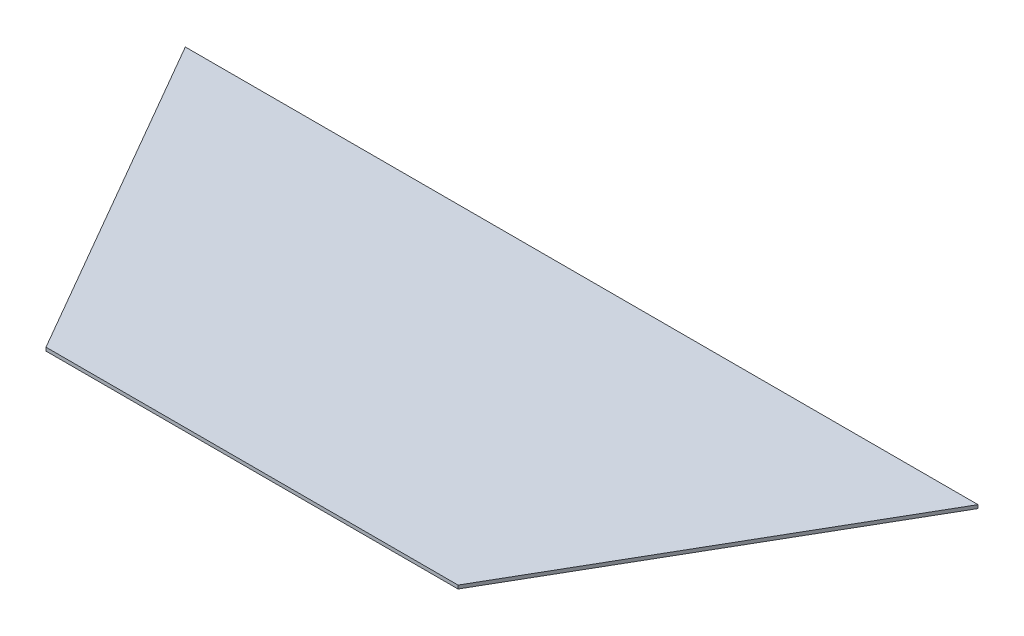
ISO-10303-21;
HEADER;
FILE_DESCRIPTION(('STEP AP214'),'2;1');
FILE_NAME('part.step','',(''),(''),'','','');
FILE_SCHEMA(('AUTOMOTIVE_DESIGN { 1 0 10303 214 1 1 1 1 }'));
ENDSEC;
DATA;
#1=APPLICATION_CONTEXT('core data for automotive mechanical design processes');
#2=APPLICATION_PROTOCOL_DEFINITION('international standard','automotive_design',2000,#1);
#3=PRODUCT_CONTEXT('',#1,'mechanical');
#4=PRODUCT('Part','Part','',(#3));
#5=PRODUCT_RELATED_PRODUCT_CATEGORY('part','',(#4));
#6=PRODUCT_DEFINITION_FORMATION('','',#4);
#7=PRODUCT_DEFINITION_CONTEXT('part definition',#1,'design');
#8=PRODUCT_DEFINITION('design','',#6,#7);
#9=PRODUCT_DEFINITION_SHAPE('','',#8);
#10=(LENGTH_UNIT() NAMED_UNIT(*) SI_UNIT(.MILLI.,.METRE.));
#11=(NAMED_UNIT(*) PLANE_ANGLE_UNIT() SI_UNIT($,.RADIAN.));
#12=(NAMED_UNIT(*) SI_UNIT($,.STERADIAN.) SOLID_ANGLE_UNIT());
#13=UNCERTAINTY_MEASURE_WITH_UNIT(LENGTH_MEASURE(1.E-05),#10,'distance_accuracy_value','');
#14=(GEOMETRIC_REPRESENTATION_CONTEXT(3) GLOBAL_UNCERTAINTY_ASSIGNED_CONTEXT((#13)) GLOBAL_UNIT_ASSIGNED_CONTEXT((#10,
#11,#12)) REPRESENTATION_CONTEXT('',''));
#15=CARTESIAN_POINT('',(0.,0.,0.));
#16=DIRECTION('',(0.,0.,1.));
#17=DIRECTION('',(1.,0.,0.));
#18=AXIS2_PLACEMENT_3D('',#15,#16,#17);
#19=CARTESIAN_POINT('',(0.,6.35,0.));
#20=DIRECTION('',(0.,1.,0.));
#21=DIRECTION('',(0.,0.,1.));
#22=AXIS2_PLACEMENT_3D('',#19,#20,#21);
#23=PLANE('',#22);
#24=DIRECTION('',(0.500000000000017,0.,-0.866025403784429));
#25=VECTOR('',#24,1.);
#26=CARTESIAN_POINT('',(381.,6.35,0.));
#27=LINE('',#26,#25);
#28=CARTESIAN_POINT('',(732.952724097978,6.35,-609.599999999995));
#29=VERTEX_POINT('',#28);
#30=CARTESIAN_POINT('',(381.,6.35,0.));
#31=VERTEX_POINT('',#30);
#32=EDGE_CURVE('E68',#29,#31,#27,.F.);
#33=ORIENTED_EDGE('',*,*,#32,.F.);
#34=DIRECTION('',(1.,0.,0.));
#35=VECTOR('',#34,1.);
#36=CARTESIAN_POINT('',(-1031.57847994737,6.35,-609.6));
#37=LINE('',#36,#35);
#38=CARTESIAN_POINT('',(-732.952724097983,6.35,-609.599999999992));
#39=VERTEX_POINT('',#38);
#40=EDGE_CURVE('E20',#29,#39,#37,.F.);
#41=ORIENTED_EDGE('',*,*,#40,.T.);
#42=DIRECTION('',(0.500000000000017,0.,0.866025403784429));
#43=VECTOR('',#42,1.);
#44=CARTESIAN_POINT('',(-762.,6.35,-659.911357683662));
#45=LINE('',#44,#43);
#46=CARTESIAN_POINT('',(-381.000000000005,6.35,3.20576898360514E-12));
#47=VERTEX_POINT('',#46);
#48=EDGE_CURVE('E58',#47,#39,#45,.F.);
#49=ORIENTED_EDGE('',*,*,#48,.F.);
#50=DIRECTION('',(1.,0.,0.));
#51=VECTOR('',#50,1.);
#52=CARTESIAN_POINT('',(-381.,6.35,0.));
#53=LINE('',#52,#51);
#54=EDGE_CURVE('E53',#31,#47,#53,.F.);
#55=ORIENTED_EDGE('',*,*,#54,.F.);
#56=EDGE_LOOP('',(#33,#41,#49,#55));
#57=FACE_BOUND('',#56,.T.);
#58=ADVANCED_FACE('F17',(#57),#23,.T.);
#59=CARTESIAN_POINT('',(-1031.57847994737,6.35,-609.6));
#60=DIRECTION('',(0.,0.,1.));
#61=DIRECTION('',(1.,0.,0.));
#62=AXIS2_PLACEMENT_3D('',#59,#60,#61);
#63=PLANE('',#62);
#64=ORIENTED_EDGE('',*,*,#40,.F.);
#65=DIRECTION('',(0.,1.,0.));
#66=VECTOR('',#65,1.);
#67=CARTESIAN_POINT('',(732.952724098001,0.,-609.599999999982));
#68=LINE('',#67,#66);
#69=CARTESIAN_POINT('',(732.952724097978,0.,-609.599999999995));
#70=VERTEX_POINT('',#69);
#71=EDGE_CURVE('E81',#70,#29,#68,.T.);
#72=ORIENTED_EDGE('',*,*,#71,.F.);
#73=DIRECTION('',(1.,0.,0.));
#74=VECTOR('',#73,1.);
#75=CARTESIAN_POINT('',(0.,0.,-609.6));
#76=LINE('',#75,#74);
#77=CARTESIAN_POINT('',(-732.952724097983,0.,-609.599999999992));
#78=VERTEX_POINT('',#77);
#79=EDGE_CURVE('E74',#70,#78,#76,.F.);
#80=ORIENTED_EDGE('',*,*,#79,.T.);
#81=DIRECTION('',(0.,1.,0.));
#82=VECTOR('',#81,1.);
#83=CARTESIAN_POINT('',(-732.952724098023,0.,-609.599999999969));
#84=LINE('',#83,#82);
#85=EDGE_CURVE('E63',#39,#78,#84,.F.);
#86=ORIENTED_EDGE('',*,*,#85,.F.);
#87=EDGE_LOOP('',(#64,#72,#80,#86));
#88=FACE_BOUND('',#87,.T.);
#89=ADVANCED_FACE('F73',(#88),#63,.F.);
#90=CARTESIAN_POINT('',(-762.,0.,-659.911357683662));
#91=DIRECTION('',(-0.866025403784429,0.,0.500000000000017));
#92=DIRECTION('',(0.500000000000017,0.,0.866025403784429));
#93=AXIS2_PLACEMENT_3D('',#90,#91,#92);
#94=PLANE('',#93);
#95=ORIENTED_EDGE('',*,*,#48,.T.);
#96=ORIENTED_EDGE('',*,*,#85,.T.);
#97=DIRECTION('',(0.499999999999972,0.,0.866025403784454));
#98=VECTOR('',#97,1.);
#99=CARTESIAN_POINT('',(-732.95272409797,0.,-609.6));
#100=LINE('',#99,#98);
#101=CARTESIAN_POINT('',(-381.000000000011,0.,6.41153796721028E-12));
#102=VERTEX_POINT('',#101);
#103=EDGE_CURVE('E84',#78,#102,#100,.T.);
#104=ORIENTED_EDGE('',*,*,#103,.T.);
#105=DIRECTION('',(0.,1.,0.));
#106=VECTOR('',#105,1.);
#107=CARTESIAN_POINT('',(-381.,0.,0.));
#108=LINE('',#107,#106);
#109=EDGE_CURVE('E65',#47,#102,#108,.F.);
#110=ORIENTED_EDGE('',*,*,#109,.F.);
#111=EDGE_LOOP('',(#95,#96,#104,#110));
#112=FACE_BOUND('',#111,.T.);
#113=ADVANCED_FACE('F60',(#112),#94,.T.);
#114=CARTESIAN_POINT('',(-381.,0.,0.));
#115=DIRECTION('',(0.,0.,1.));
#116=DIRECTION('',(1.,0.,0.));
#117=AXIS2_PLACEMENT_3D('',#114,#115,#116);
#118=PLANE('',#117);
#119=ORIENTED_EDGE('',*,*,#109,.T.);
#120=DIRECTION('',(1.,0.,0.));
#121=VECTOR('',#120,1.);
#122=CARTESIAN_POINT('',(0.,0.,0.));
#123=LINE('',#122,#121);
#124=CARTESIAN_POINT('',(381.,0.,0.));
#125=VERTEX_POINT('',#124);
#126=EDGE_CURVE('E26',#102,#125,#123,.T.);
#127=ORIENTED_EDGE('',*,*,#126,.T.);
#128=DIRECTION('',(0.,1.,0.));
#129=VECTOR('',#128,1.);
#130=CARTESIAN_POINT('',(381.,0.,0.));
#131=LINE('',#130,#129);
#132=EDGE_CURVE('E34',#31,#125,#131,.F.);
#133=ORIENTED_EDGE('',*,*,#132,.F.);
#134=ORIENTED_EDGE('',*,*,#54,.T.);
#135=EDGE_LOOP('',(#119,#127,#133,#134));
#136=FACE_BOUND('',#135,.T.);
#137=ADVANCED_FACE('F88',(#136),#118,.T.);
#138=CARTESIAN_POINT('',(381.,0.,0.));
#139=DIRECTION('',(0.866025403784429,0.,0.500000000000017));
#140=DIRECTION('',(0.500000000000017,0.,-0.866025403784429));
#141=AXIS2_PLACEMENT_3D('',#138,#139,#140);
#142=PLANE('',#141);
#143=DIRECTION('',(0.499999999999972,0.,-0.866025403784454));
#144=VECTOR('',#143,1.);
#145=CARTESIAN_POINT('',(381.,0.,0.));
#146=LINE('',#145,#144);
#147=EDGE_CURVE('E11',#125,#70,#146,.T.);
#148=ORIENTED_EDGE('',*,*,#147,.T.);
#149=ORIENTED_EDGE('',*,*,#71,.T.);
#150=ORIENTED_EDGE('',*,*,#32,.T.);
#151=ORIENTED_EDGE('',*,*,#132,.T.);
#152=EDGE_LOOP('',(#148,#149,#150,#151));
#153=FACE_BOUND('',#152,.T.);
#154=ADVANCED_FACE('F91',(#153),#142,.T.);
#155=CARTESIAN_POINT('',(0.,0.,0.));
#156=DIRECTION('',(0.,1.,0.));
#157=DIRECTION('',(0.,0.,1.));
#158=AXIS2_PLACEMENT_3D('',#155,#156,#157);
#159=PLANE('',#158);
#160=ORIENTED_EDGE('',*,*,#126,.F.);
#161=ORIENTED_EDGE('',*,*,#103,.F.);
#162=ORIENTED_EDGE('',*,*,#79,.F.);
#163=ORIENTED_EDGE('',*,*,#147,.F.);
#164=EDGE_LOOP('',(#160,#161,#162,#163));
#165=FACE_BOUND('',#164,.T.);
#166=ADVANCED_FACE('F90',(#165),#159,.F.);
#167=CLOSED_SHELL('',(#58,#89,#113,#137,#154,#166));
#168=MANIFOLD_SOLID_BREP('B1',#167);
#169=ADVANCED_BREP_SHAPE_REPRESENTATION('',(#18,#168),#14);
#170=SHAPE_DEFINITION_REPRESENTATION(#9,#169);
ENDSEC;
END-ISO-10303-21;
